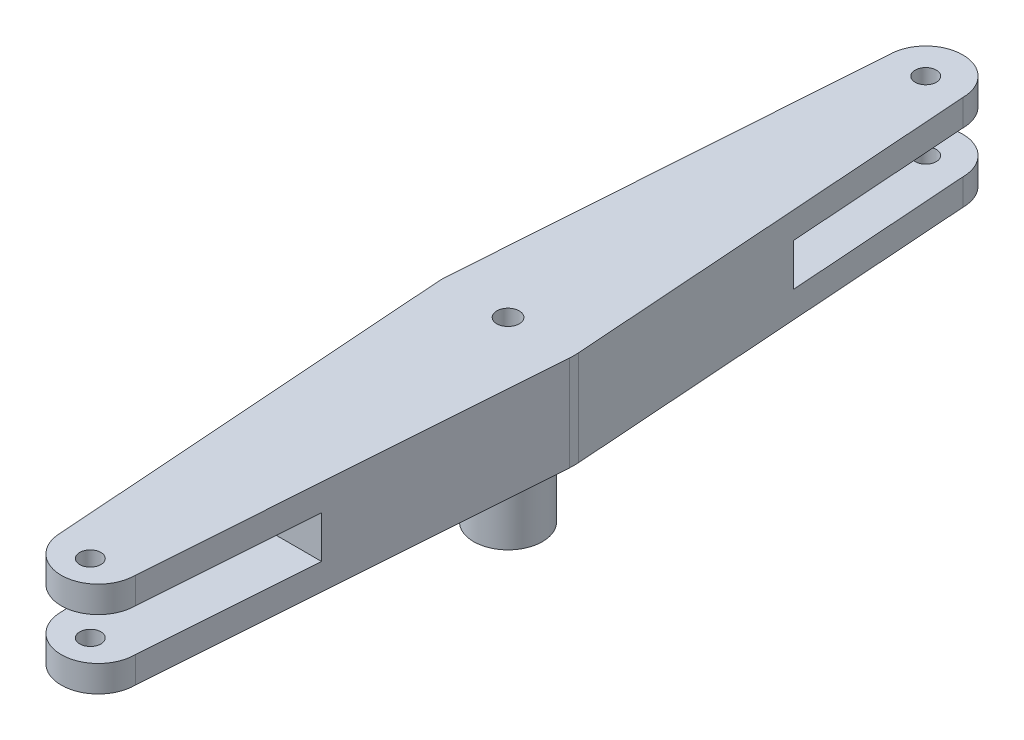
ISO-10303-21;
HEADER;
FILE_DESCRIPTION(('STEP AP214'),'2;1');
FILE_NAME('part.step','',(''),(''),'','','');
FILE_SCHEMA(('AUTOMOTIVE_DESIGN { 1 0 10303 214 1 1 1 1 }'));
ENDSEC;
DATA;
#1=APPLICATION_CONTEXT('core data for automotive mechanical design processes');
#2=APPLICATION_PROTOCOL_DEFINITION('international standard','automotive_design',2000,#1);
#3=PRODUCT_CONTEXT('',#1,'mechanical');
#4=PRODUCT('Part','Part','',(#3));
#5=PRODUCT_RELATED_PRODUCT_CATEGORY('part','',(#4));
#6=PRODUCT_DEFINITION_FORMATION('','',#4);
#7=PRODUCT_DEFINITION_CONTEXT('part definition',#1,'design');
#8=PRODUCT_DEFINITION('design','',#6,#7);
#9=PRODUCT_DEFINITION_SHAPE('','',#8);
#10=(LENGTH_UNIT() NAMED_UNIT(*) SI_UNIT(.MILLI.,.METRE.));
#11=(NAMED_UNIT(*) PLANE_ANGLE_UNIT() SI_UNIT($,.RADIAN.));
#12=(NAMED_UNIT(*) SI_UNIT($,.STERADIAN.) SOLID_ANGLE_UNIT());
#13=UNCERTAINTY_MEASURE_WITH_UNIT(LENGTH_MEASURE(1.E-05),#10,'distance_accuracy_value','');
#14=(GEOMETRIC_REPRESENTATION_CONTEXT(3) GLOBAL_UNCERTAINTY_ASSIGNED_CONTEXT((#13)) GLOBAL_UNIT_ASSIGNED_CONTEXT((#10,
#11,#12)) REPRESENTATION_CONTEXT('',''));
#15=CARTESIAN_POINT('',(0.,0.,0.));
#16=DIRECTION('',(0.,0.,1.));
#17=DIRECTION('',(1.,0.,0.));
#18=AXIS2_PLACEMENT_3D('',#15,#16,#17);
#19=CARTESIAN_POINT('',(0.,5.,-79.));
#20=DIRECTION('',(0.,1.,0.));
#21=DIRECTION('',(0.,0.,1.));
#22=AXIS2_PLACEMENT_3D('',#19,#20,#21);
#23=PLANE('',#22);
#24=DIRECTION('',(1.,0.,0.));
#25=VECTOR('',#24,1.);
#26=CARTESIAN_POINT('',(-9.34696599194239,5.,44.6192395746421));
#27=LINE('',#26,#25);
#28=CARTESIAN_POINT('',(-9.34696599194239,5.,44.6192395746421));
#29=VERTEX_POINT('',#28);
#30=CARTESIAN_POINT('',(9.34696599194239,5.,44.6192395746421));
#31=VERTEX_POINT('',#30);
#32=EDGE_CURVE('E223',#29,#31,#27,.T.);
#33=ORIENTED_EDGE('',*,*,#32,.F.);
#34=DIRECTION('',(0.0711969556498861,0.,0.997462276733405));
#35=VECTOR('',#34,1.);
#36=CARTESIAN_POINT('',(-12.4682784591676,5.,0.889961945623576));
#37=LINE('',#36,#35);
#38=CARTESIAN_POINT('',(-6.99999999999999,5.,77.5));
#39=VERTEX_POINT('',#38);
#40=EDGE_CURVE('E262',#29,#39,#37,.T.);
#41=ORIENTED_EDGE('',*,*,#40,.T.);
#42=CARTESIAN_POINT('',(0.,5.,77.5));
#43=DIRECTION('',(0.,1.,0.));
#44=DIRECTION('',(0.,0.,1.));
#45=AXIS2_PLACEMENT_3D('',#42,#43,#44);
#46=CIRCLE('',#45,6.99999999999999);
#47=CARTESIAN_POINT('',(7.,5.,77.5));
#48=VERTEX_POINT('',#47);
#49=EDGE_CURVE('E264',#39,#48,#46,.T.);
#50=ORIENTED_EDGE('',*,*,#49,.T.);
#51=DIRECTION('',(0.0711969556498861,0.,-0.997462276733405));
#52=VECTOR('',#51,1.);
#53=CARTESIAN_POINT('',(12.4682784591676,5.,0.889961945623576));
#54=LINE('',#53,#52);
#55=EDGE_CURVE('E64',#48,#31,#54,.T.);
#56=ORIENTED_EDGE('',*,*,#55,.T.);
#57=EDGE_LOOP('',(#33,#41,#50,#56));
#58=FACE_BOUND('',#57,.T.);
#59=CARTESIAN_POINT('',(0.,5.,79.));
#60=DIRECTION('',(0.,1.,0.));
#61=DIRECTION('',(0.,0.,-1.));
#62=AXIS2_PLACEMENT_3D('',#59,#60,#61);
#63=CIRCLE('',#62,2.);
#64=CARTESIAN_POINT('',(0.,5.,77.));
#65=VERTEX_POINT('',#64);
#66=EDGE_CURVE('E242',#65,#65,#63,.T.);
#67=ORIENTED_EDGE('',*,*,#66,.F.);
#68=EDGE_LOOP('',(#67));
#69=FACE_BOUND('',#68,.T.);
#70=ADVANCED_FACE('F39',(#58,#69),#23,.T.);
#71=DIRECTION('',(-1.,0.,0.));
#72=VECTOR('',#71,1.);
#73=CARTESIAN_POINT('',(-9.40691179962771,5.,-44.6192395746421));
#74=LINE('',#73,#72);
#75=CARTESIAN_POINT('',(9.40691179962771,5.,-44.6192395746421));
#76=VERTEX_POINT('',#75);
#77=CARTESIAN_POINT('',(-9.40691179962771,5.,-44.6192395746421));
#78=VERTEX_POINT('',#77);
#79=EDGE_CURVE('E56',#76,#78,#74,.T.);
#80=ORIENTED_EDGE('',*,*,#79,.F.);
#81=DIRECTION('',(-0.0698365935248016,0.,-0.99755844450581));
#82=VECTOR('',#81,1.);
#83=CARTESIAN_POINT('',(12.4694805563226,5.,-0.87295741906002));
#84=LINE('',#83,#82);
#85=CARTESIAN_POINT('',(7.,5.,-79.));
#86=VERTEX_POINT('',#85);
#87=EDGE_CURVE('E267',#76,#86,#84,.T.);
#88=ORIENTED_EDGE('',*,*,#87,.T.);
#89=CARTESIAN_POINT('',(0.,5.,-79.));
#90=DIRECTION('',(0.,1.,0.));
#91=DIRECTION('',(0.,0.,1.));
#92=AXIS2_PLACEMENT_3D('',#89,#90,#91);
#93=CIRCLE('',#92,7.);
#94=CARTESIAN_POINT('',(-7.,5.,-79.));
#95=VERTEX_POINT('',#94);
#96=EDGE_CURVE('E256',#86,#95,#93,.T.);
#97=ORIENTED_EDGE('',*,*,#96,.T.);
#98=DIRECTION('',(-0.0698365935248016,0.,0.99755844450581));
#99=VECTOR('',#98,1.);
#100=CARTESIAN_POINT('',(-7.,5.,-79.));
#101=LINE('',#100,#99);
#102=EDGE_CURVE('E259',#95,#78,#101,.T.);
#103=ORIENTED_EDGE('',*,*,#102,.T.);
#104=EDGE_LOOP('',(#80,#88,#97,#103));
#105=FACE_BOUND('',#104,.T.);
#106=CARTESIAN_POINT('',(0.,5.,-79.));
#107=DIRECTION('',(0.,1.,0.));
#108=DIRECTION('',(0.,0.,1.));
#109=AXIS2_PLACEMENT_3D('',#106,#107,#108);
#110=CIRCLE('',#109,2.);
#111=CARTESIAN_POINT('',(0.,5.,-77.));
#112=VERTEX_POINT('',#111);
#113=EDGE_CURVE('E243',#112,#112,#110,.T.);
#114=ORIENTED_EDGE('',*,*,#113,.F.);
#115=EDGE_LOOP('',(#114));
#116=FACE_BOUND('',#115,.T.);
#117=ADVANCED_FACE('F361',(#105,#116),#23,.T.);
#118=CARTESIAN_POINT('',(0.,0.,-79.));
#119=DIRECTION('',(0.,1.,0.));
#120=DIRECTION('',(0.,0.,1.));
#121=AXIS2_PLACEMENT_3D('',#118,#119,#120);
#122=PLANE('',#121);
#123=CARTESIAN_POINT('',(0.,0.,0.));
#124=DIRECTION('',(0.,1.,0.));
#125=DIRECTION('',(0.,0.,1.));
#126=AXIS2_PLACEMENT_3D('',#123,#124,#125);
#127=CIRCLE('',#126,6.5);
#128=CARTESIAN_POINT('',(0.,0.,6.5));
#129=VERTEX_POINT('',#128);
#130=EDGE_CURVE('E11',#129,#129,#127,.F.);
#131=ORIENTED_EDGE('',*,*,#130,.F.);
#132=EDGE_LOOP('',(#131));
#133=FACE_BOUND('',#132,.T.);
#134=CARTESIAN_POINT('',(0.,0.,-79.));
#135=DIRECTION('',(0.,1.,0.));
#136=DIRECTION('',(0.,0.,1.));
#137=AXIS2_PLACEMENT_3D('',#134,#135,#136);
#138=CIRCLE('',#137,2.);
#139=CARTESIAN_POINT('',(0.,0.,-77.));
#140=VERTEX_POINT('',#139);
#141=EDGE_CURVE('E255',#140,#140,#138,.T.);
#142=ORIENTED_EDGE('',*,*,#141,.T.);
#143=EDGE_LOOP('',(#142));
#144=FACE_BOUND('',#143,.T.);
#145=CARTESIAN_POINT('',(0.,0.,79.));
#146=DIRECTION('',(0.,1.,0.));
#147=DIRECTION('',(0.,0.,1.));
#148=AXIS2_PLACEMENT_3D('',#145,#146,#147);
#149=CIRCLE('',#148,2.);
#150=CARTESIAN_POINT('',(0.,0.,81.));
#151=VERTEX_POINT('',#150);
#152=EDGE_CURVE('E246',#151,#151,#149,.T.);
#153=ORIENTED_EDGE('',*,*,#152,.T.);
#154=EDGE_LOOP('',(#153));
#155=FACE_BOUND('',#154,.T.);
#156=CARTESIAN_POINT('',(0.,0.,-79.));
#157=DIRECTION('',(0.,1.,0.));
#158=DIRECTION('',(0.,0.,1.));
#159=AXIS2_PLACEMENT_3D('',#156,#157,#158);
#160=CIRCLE('',#159,7.);
#161=CARTESIAN_POINT('',(7.,0.,-79.));
#162=VERTEX_POINT('',#161);
#163=CARTESIAN_POINT('',(-7.,0.,-79.));
#164=VERTEX_POINT('',#163);
#165=EDGE_CURVE('E254',#162,#164,#160,.T.);
#166=ORIENTED_EDGE('',*,*,#165,.F.);
#167=DIRECTION('',(-0.0698365935248016,0.,-0.99755844450581));
#168=VECTOR('',#167,1.);
#169=CARTESIAN_POINT('',(12.4694805563226,0.,-0.87295741906002));
#170=LINE('',#169,#168);
#171=CARTESIAN_POINT('',(12.4694805563226,0.,-0.87295741906002));
#172=VERTEX_POINT('',#171);
#173=EDGE_CURVE('E260',#172,#162,#170,.T.);
#174=ORIENTED_EDGE('',*,*,#173,.F.);
#175=CARTESIAN_POINT('',(0.,0.,0.));
#176=DIRECTION('',(0.,1.,0.));
#177=DIRECTION('',(0.,0.,1.));
#178=AXIS2_PLACEMENT_3D('',#175,#176,#177);
#179=CIRCLE('',#178,12.5);
#180=CARTESIAN_POINT('',(12.4682784591676,0.,0.889961945623576));
#181=VERTEX_POINT('',#180);
#182=EDGE_CURVE('E282',#181,#172,#179,.T.);
#183=ORIENTED_EDGE('',*,*,#182,.F.);
#184=DIRECTION('',(0.0711969556498861,0.,-0.997462276733405));
#185=VECTOR('',#184,1.);
#186=CARTESIAN_POINT('',(12.4682784591676,0.,0.889961945623576));
#187=LINE('',#186,#185);
#188=CARTESIAN_POINT('',(7.,0.,77.5));
#189=VERTEX_POINT('',#188);
#190=EDGE_CURVE('E280',#189,#181,#187,.T.);
#191=ORIENTED_EDGE('',*,*,#190,.F.);
#192=CARTESIAN_POINT('',(0.,0.,77.5));
#193=DIRECTION('',(0.,1.,0.));
#194=DIRECTION('',(0.,0.,1.));
#195=AXIS2_PLACEMENT_3D('',#192,#193,#194);
#196=CIRCLE('',#195,6.99999999999999);
#197=CARTESIAN_POINT('',(-6.99999999999999,0.,77.5));
#198=VERTEX_POINT('',#197);
#199=EDGE_CURVE('E278',#198,#189,#196,.T.);
#200=ORIENTED_EDGE('',*,*,#199,.F.);
#201=DIRECTION('',(0.0711969556498861,0.,0.997462276733405));
#202=VECTOR('',#201,1.);
#203=CARTESIAN_POINT('',(-12.4682784591676,0.,0.889961945623576));
#204=LINE('',#203,#202);
#205=CARTESIAN_POINT('',(-12.4682784591676,0.,0.889961945623566));
#206=VERTEX_POINT('',#205);
#207=EDGE_CURVE('E276',#206,#198,#204,.T.);
#208=ORIENTED_EDGE('',*,*,#207,.F.);
#209=CARTESIAN_POINT('',(0.,0.,0.));
#210=DIRECTION('',(0.,1.,0.));
#211=DIRECTION('',(0.,0.,1.));
#212=AXIS2_PLACEMENT_3D('',#209,#210,#211);
#213=CIRCLE('',#212,12.5);
#214=CARTESIAN_POINT('',(-12.4694805563226,0.,-0.87295741906002));
#215=VERTEX_POINT('',#214);
#216=EDGE_CURVE('E274',#215,#206,#213,.T.);
#217=ORIENTED_EDGE('',*,*,#216,.F.);
#218=DIRECTION('',(-0.0698365935248016,0.,0.99755844450581));
#219=VECTOR('',#218,1.);
#220=CARTESIAN_POINT('',(-7.,0.,-79.));
#221=LINE('',#220,#219);
#222=EDGE_CURVE('E272',#164,#215,#221,.T.);
#223=ORIENTED_EDGE('',*,*,#222,.F.);
#224=EDGE_LOOP('',(#166,#174,#183,#191,#200,#208,#217,#223));
#225=FACE_BOUND('',#224,.T.);
#226=ADVANCED_FACE('F366',(#133,#144,#155,#225),#122,.F.);
#227=CARTESIAN_POINT('',(0.,5.,-79.));
#228=DIRECTION('',(0.,-1.,0.));
#229=DIRECTION('',(0.,0.,-1.));
#230=AXIS2_PLACEMENT_3D('',#227,#228,#229);
#231=CYLINDRICAL_SURFACE('',#230,7.);
#232=ORIENTED_EDGE('',*,*,#165,.T.);
#233=DIRECTION('',(0.,-1.,0.));
#234=VECTOR('',#233,1.);
#235=CARTESIAN_POINT('',(-7.,5.,-79.));
#236=LINE('',#235,#234);
#237=EDGE_CURVE('E48',#95,#164,#236,.T.);
#238=ORIENTED_EDGE('',*,*,#237,.F.);
#239=ORIENTED_EDGE('',*,*,#96,.F.);
#240=DIRECTION('',(0.,-1.,0.));
#241=VECTOR('',#240,1.);
#242=CARTESIAN_POINT('',(7.,5.,-79.));
#243=LINE('',#242,#241);
#244=EDGE_CURVE('E269',#86,#162,#243,.T.);
#245=ORIENTED_EDGE('',*,*,#244,.T.);
#246=EDGE_LOOP('',(#232,#238,#239,#245));
#247=FACE_BOUND('',#246,.T.);
#248=ADVANCED_FACE('F41',(#247),#231,.T.);
#249=CARTESIAN_POINT('',(-7.,5.,-79.));
#250=DIRECTION('',(0.99755844450581,0.,0.0698365935248016));
#251=DIRECTION('',(0.0698365935248016,0.,-0.99755844450581));
#252=AXIS2_PLACEMENT_3D('',#249,#250,#251);
#253=PLANE('',#252);
#254=ORIENTED_EDGE('',*,*,#222,.T.);
#255=DIRECTION('',(0.,-1.,0.));
#256=VECTOR('',#255,1.);
#257=CARTESIAN_POINT('',(-12.4694805563226,5.,-0.87295741906002));
#258=LINE('',#257,#256);
#259=CARTESIAN_POINT('',(-12.4694805563226,18.,-0.87295741906002));
#260=VERTEX_POINT('',#259);
#261=EDGE_CURVE('E302',#260,#215,#258,.T.);
#262=ORIENTED_EDGE('',*,*,#261,.F.);
#263=DIRECTION('',(-0.0698365935248016,0.,0.99755844450581));
#264=VECTOR('',#263,1.);
#265=CARTESIAN_POINT('',(-7.,18.,-79.));
#266=LINE('',#265,#264);
#267=CARTESIAN_POINT('',(-7.,18.,-79.));
#268=VERTEX_POINT('',#267);
#269=EDGE_CURVE('E180',#268,#260,#266,.T.);
#270=ORIENTED_EDGE('',*,*,#269,.F.);
#271=DIRECTION('',(0.,1.,0.));
#272=VECTOR('',#271,1.);
#273=CARTESIAN_POINT('',(-7.,13.,-79.));
#274=LINE('',#273,#272);
#275=CARTESIAN_POINT('',(-7.,13.,-79.));
#276=VERTEX_POINT('',#275);
#277=EDGE_CURVE('E197',#276,#268,#274,.T.);
#278=ORIENTED_EDGE('',*,*,#277,.F.);
#279=DIRECTION('',(-0.0698365935248016,0.,0.99755844450581));
#280=VECTOR('',#279,1.);
#281=CARTESIAN_POINT('',(-7.,13.,-79.));
#282=LINE('',#281,#280);
#283=CARTESIAN_POINT('',(-9.40691179962771,13.,-44.6192395746421));
#284=VERTEX_POINT('',#283);
#285=EDGE_CURVE('E179',#276,#284,#282,.T.);
#286=ORIENTED_EDGE('',*,*,#285,.T.);
#287=DIRECTION('',(0.,-1.,0.));
#288=VECTOR('',#287,1.);
#289=CARTESIAN_POINT('',(-9.40691179962771,13.,-44.6192395746421));
#290=LINE('',#289,#288);
#291=EDGE_CURVE('E234',#284,#78,#290,.T.);
#292=ORIENTED_EDGE('',*,*,#291,.T.);
#293=ORIENTED_EDGE('',*,*,#102,.F.);
#294=ORIENTED_EDGE('',*,*,#237,.T.);
#295=EDGE_LOOP('',(#254,#262,#270,#278,#286,#292,#293,#294));
#296=FACE_BOUND('',#295,.T.);
#297=ADVANCED_FACE('F396',(#296),#253,.F.);
#298=CARTESIAN_POINT('',(0.,5.,0.));
#299=DIRECTION('',(0.,-1.,0.));
#300=DIRECTION('',(0.,0.,-1.));
#301=AXIS2_PLACEMENT_3D('',#298,#299,#300);
#302=CYLINDRICAL_SURFACE('',#301,12.5);
#303=ORIENTED_EDGE('',*,*,#216,.T.);
#304=DIRECTION('',(0.,-1.,0.));
#305=VECTOR('',#304,1.);
#306=CARTESIAN_POINT('',(-12.4682784591676,5.,0.889961945623566));
#307=LINE('',#306,#305);
#308=CARTESIAN_POINT('',(-12.4682784591676,18.,0.889961945623566));
#309=VERTEX_POINT('',#308);
#310=EDGE_CURVE('E299',#309,#206,#307,.T.);
#311=ORIENTED_EDGE('',*,*,#310,.F.);
#312=CARTESIAN_POINT('',(0.,18.,0.));
#313=DIRECTION('',(0.,1.,0.));
#314=DIRECTION('',(0.,0.,1.));
#315=AXIS2_PLACEMENT_3D('',#312,#313,#314);
#316=CIRCLE('',#315,12.5);
#317=EDGE_CURVE('E183',#260,#309,#316,.T.);
#318=ORIENTED_EDGE('',*,*,#317,.F.);
#319=ORIENTED_EDGE('',*,*,#261,.T.);
#320=EDGE_LOOP('',(#303,#311,#318,#319));
#321=FACE_BOUND('',#320,.T.);
#322=ADVANCED_FACE('F393',(#321),#302,.T.);
#323=CARTESIAN_POINT('',(-12.4682784591676,5.,0.889961945623576));
#324=DIRECTION('',(0.997462276733405,0.,-0.0711969556498861));
#325=DIRECTION('',(-0.0711969556498861,0.,-0.997462276733405));
#326=AXIS2_PLACEMENT_3D('',#323,#324,#325);
#327=PLANE('',#326);
#328=ORIENTED_EDGE('',*,*,#207,.T.);
#329=DIRECTION('',(0.,-1.,0.));
#330=VECTOR('',#329,1.);
#331=CARTESIAN_POINT('',(-6.99999999999999,5.,77.5));
#332=LINE('',#331,#330);
#333=EDGE_CURVE('E296',#39,#198,#332,.T.);
#334=ORIENTED_EDGE('',*,*,#333,.F.);
#335=ORIENTED_EDGE('',*,*,#40,.F.);
#336=DIRECTION('',(0.,-1.,0.));
#337=VECTOR('',#336,1.);
#338=CARTESIAN_POINT('',(-9.34696599194239,13.,44.6192395746421));
#339=LINE('',#338,#337);
#340=CARTESIAN_POINT('',(-9.34696599194239,13.,44.6192395746421));
#341=VERTEX_POINT('',#340);
#342=EDGE_CURVE('E231',#341,#29,#339,.T.);
#343=ORIENTED_EDGE('',*,*,#342,.F.);
#344=DIRECTION('',(0.0711969556498861,0.,0.997462276733405));
#345=VECTOR('',#344,1.);
#346=CARTESIAN_POINT('',(-12.4682784591676,13.,0.889961945623576));
#347=LINE('',#346,#345);
#348=CARTESIAN_POINT('',(-6.99999999999999,13.,77.5));
#349=VERTEX_POINT('',#348);
#350=EDGE_CURVE('E194',#341,#349,#347,.T.);
#351=ORIENTED_EDGE('',*,*,#350,.T.);
#352=DIRECTION('',(0.,1.,0.));
#353=VECTOR('',#352,1.);
#354=CARTESIAN_POINT('',(-6.99999999999999,13.,77.5));
#355=LINE('',#354,#353);
#356=CARTESIAN_POINT('',(-6.99999999999999,18.,77.5));
#357=VERTEX_POINT('',#356);
#358=EDGE_CURVE('E217',#349,#357,#355,.T.);
#359=ORIENTED_EDGE('',*,*,#358,.T.);
#360=DIRECTION('',(0.0711969556498861,0.,0.997462276733405));
#361=VECTOR('',#360,1.);
#362=CARTESIAN_POINT('',(-12.4682784591676,18.,0.889961945623576));
#363=LINE('',#362,#361);
#364=EDGE_CURVE('E211',#309,#357,#363,.T.);
#365=ORIENTED_EDGE('',*,*,#364,.F.);
#366=ORIENTED_EDGE('',*,*,#310,.T.);
#367=EDGE_LOOP('',(#328,#334,#335,#343,#351,#359,#365,#366));
#368=FACE_BOUND('',#367,.T.);
#369=ADVANCED_FACE('F389',(#368),#327,.F.);
#370=CARTESIAN_POINT('',(0.,5.,77.5));
#371=DIRECTION('',(0.,-1.,0.));
#372=DIRECTION('',(0.,0.,-1.));
#373=AXIS2_PLACEMENT_3D('',#370,#371,#372);
#374=CYLINDRICAL_SURFACE('',#373,6.99999999999999);
#375=ORIENTED_EDGE('',*,*,#199,.T.);
#376=DIRECTION('',(0.,-1.,0.));
#377=VECTOR('',#376,1.);
#378=CARTESIAN_POINT('',(7.,5.,77.5));
#379=LINE('',#378,#377);
#380=EDGE_CURVE('E293',#48,#189,#379,.T.);
#381=ORIENTED_EDGE('',*,*,#380,.F.);
#382=ORIENTED_EDGE('',*,*,#49,.F.);
#383=ORIENTED_EDGE('',*,*,#333,.T.);
#384=EDGE_LOOP('',(#375,#381,#382,#383));
#385=FACE_BOUND('',#384,.T.);
#386=ADVANCED_FACE('F385',(#385),#374,.T.);
#387=CARTESIAN_POINT('',(12.4682784591676,5.,0.889961945623576));
#388=DIRECTION('',(-0.997462276733405,0.,-0.0711969556498861));
#389=DIRECTION('',(-0.0711969556498861,0.,0.997462276733405));
#390=AXIS2_PLACEMENT_3D('',#387,#388,#389);
#391=PLANE('',#390);
#392=ORIENTED_EDGE('',*,*,#190,.T.);
#393=DIRECTION('',(0.,-1.,0.));
#394=VECTOR('',#393,1.);
#395=CARTESIAN_POINT('',(12.4682784591676,5.,0.889961945623576));
#396=LINE('',#395,#394);
#397=CARTESIAN_POINT('',(12.4682784591676,18.,0.889961945623576));
#398=VERTEX_POINT('',#397);
#399=EDGE_CURVE('E290',#398,#181,#396,.T.);
#400=ORIENTED_EDGE('',*,*,#399,.F.);
#401=DIRECTION('',(0.0711969556498861,0.,-0.997462276733405));
#402=VECTOR('',#401,1.);
#403=CARTESIAN_POINT('',(12.4682784591676,18.,0.889961945623576));
#404=LINE('',#403,#402);
#405=CARTESIAN_POINT('',(7.,18.,77.5));
#406=VERTEX_POINT('',#405);
#407=EDGE_CURVE('E205',#406,#398,#404,.T.);
#408=ORIENTED_EDGE('',*,*,#407,.F.);
#409=DIRECTION('',(0.,1.,0.));
#410=VECTOR('',#409,1.);
#411=CARTESIAN_POINT('',(7.,13.,77.5));
#412=LINE('',#411,#410);
#413=CARTESIAN_POINT('',(7.,13.,77.5));
#414=VERTEX_POINT('',#413);
#415=EDGE_CURVE('E175',#414,#406,#412,.T.);
#416=ORIENTED_EDGE('',*,*,#415,.F.);
#417=DIRECTION('',(0.0711969556498861,0.,-0.997462276733405));
#418=VECTOR('',#417,1.);
#419=CARTESIAN_POINT('',(12.4682784591676,13.,0.889961945623576));
#420=LINE('',#419,#418);
#421=CARTESIAN_POINT('',(9.34696599194239,13.,44.6192395746421));
#422=VERTEX_POINT('',#421);
#423=EDGE_CURVE('E165',#414,#422,#420,.T.);
#424=ORIENTED_EDGE('',*,*,#423,.T.);
#425=DIRECTION('',(0.,-1.,0.));
#426=VECTOR('',#425,1.);
#427=CARTESIAN_POINT('',(9.34696599194239,13.,44.6192395746421));
#428=LINE('',#427,#426);
#429=EDGE_CURVE('E226',#422,#31,#428,.T.);
#430=ORIENTED_EDGE('',*,*,#429,.T.);
#431=ORIENTED_EDGE('',*,*,#55,.F.);
#432=ORIENTED_EDGE('',*,*,#380,.T.);
#433=EDGE_LOOP('',(#392,#400,#408,#416,#424,#430,#431,#432));
#434=FACE_BOUND('',#433,.T.);
#435=ADVANCED_FACE('F381',(#434),#391,.F.);
#436=CARTESIAN_POINT('',(0.,5.,0.));
#437=DIRECTION('',(0.,-1.,0.));
#438=DIRECTION('',(0.,0.,-1.));
#439=AXIS2_PLACEMENT_3D('',#436,#437,#438);
#440=CYLINDRICAL_SURFACE('',#439,12.5);
#441=ORIENTED_EDGE('',*,*,#182,.T.);
#442=DIRECTION('',(0.,-1.,0.));
#443=VECTOR('',#442,1.);
#444=CARTESIAN_POINT('',(12.4694805563226,5.,-0.87295741906002));
#445=LINE('',#444,#443);
#446=CARTESIAN_POINT('',(12.4694805563226,18.,-0.87295741906002));
#447=VERTEX_POINT('',#446);
#448=EDGE_CURVE('E287',#447,#172,#445,.T.);
#449=ORIENTED_EDGE('',*,*,#448,.F.);
#450=CARTESIAN_POINT('',(0.,18.,0.));
#451=DIRECTION('',(0.,1.,0.));
#452=DIRECTION('',(0.,0.,1.));
#453=AXIS2_PLACEMENT_3D('',#450,#451,#452);
#454=CIRCLE('',#453,12.5);
#455=EDGE_CURVE('E202',#398,#447,#454,.T.);
#456=ORIENTED_EDGE('',*,*,#455,.F.);
#457=ORIENTED_EDGE('',*,*,#399,.T.);
#458=EDGE_LOOP('',(#441,#449,#456,#457));
#459=FACE_BOUND('',#458,.T.);
#460=ADVANCED_FACE('F378',(#459),#440,.T.);
#461=CARTESIAN_POINT('',(12.4694805563226,5.,-0.87295741906002));
#462=DIRECTION('',(-0.99755844450581,0.,0.0698365935248016));
#463=DIRECTION('',(0.0698365935248016,0.,0.99755844450581));
#464=AXIS2_PLACEMENT_3D('',#461,#462,#463);
#465=PLANE('',#464);
#466=ORIENTED_EDGE('',*,*,#173,.T.);
#467=ORIENTED_EDGE('',*,*,#244,.F.);
#468=ORIENTED_EDGE('',*,*,#87,.F.);
#469=DIRECTION('',(0.,-1.,0.));
#470=VECTOR('',#469,1.);
#471=CARTESIAN_POINT('',(9.40691179962771,13.,-44.6192395746421));
#472=LINE('',#471,#470);
#473=CARTESIAN_POINT('',(9.40691179962771,13.,-44.6192395746421));
#474=VERTEX_POINT('',#473);
#475=EDGE_CURVE('E161',#474,#76,#472,.T.);
#476=ORIENTED_EDGE('',*,*,#475,.F.);
#477=DIRECTION('',(-0.0698365935248016,0.,-0.99755844450581));
#478=VECTOR('',#477,1.);
#479=CARTESIAN_POINT('',(12.4694805563226,13.,-0.87295741906002));
#480=LINE('',#479,#478);
#481=CARTESIAN_POINT('',(7.,13.,-79.));
#482=VERTEX_POINT('',#481);
#483=EDGE_CURVE('E154',#474,#482,#480,.T.);
#484=ORIENTED_EDGE('',*,*,#483,.T.);
#485=DIRECTION('',(0.,1.,0.));
#486=VECTOR('',#485,1.);
#487=CARTESIAN_POINT('',(7.,13.,-79.));
#488=LINE('',#487,#486);
#489=CARTESIAN_POINT('',(7.,18.,-79.));
#490=VERTEX_POINT('',#489);
#491=EDGE_CURVE('E158',#482,#490,#488,.T.);
#492=ORIENTED_EDGE('',*,*,#491,.T.);
#493=DIRECTION('',(-0.0698365935248016,0.,-0.99755844450581));
#494=VECTOR('',#493,1.);
#495=CARTESIAN_POINT('',(12.4694805563226,18.,-0.87295741906002));
#496=LINE('',#495,#494);
#497=EDGE_CURVE('E199',#447,#490,#496,.T.);
#498=ORIENTED_EDGE('',*,*,#497,.F.);
#499=ORIENTED_EDGE('',*,*,#448,.T.);
#500=EDGE_LOOP('',(#466,#467,#468,#476,#484,#492,#498,#499));
#501=FACE_BOUND('',#500,.T.);
#502=ADVANCED_FACE('F156',(#501),#465,.F.);
#503=CARTESIAN_POINT('',(0.,-5.,79.));
#504=DIRECTION('',(0.,1.,0.));
#505=DIRECTION('',(0.,0.,1.));
#506=AXIS2_PLACEMENT_3D('',#503,#504,#505);
#507=CYLINDRICAL_SURFACE('',#506,2.);
#508=ORIENTED_EDGE('',*,*,#66,.T.);
#509=EDGE_LOOP('',(#508));
#510=FACE_BOUND('',#509,.T.);
#511=ORIENTED_EDGE('',*,*,#152,.F.);
#512=EDGE_LOOP('',(#511));
#513=FACE_BOUND('',#512,.T.);
#514=ADVANCED_FACE('F377',(#510,#513),#507,.F.);
#515=CARTESIAN_POINT('',(0.,-5.,-79.));
#516=DIRECTION('',(0.,1.,0.));
#517=DIRECTION('',(0.,0.,1.));
#518=AXIS2_PLACEMENT_3D('',#515,#516,#517);
#519=CYLINDRICAL_SURFACE('',#518,2.);
#520=ORIENTED_EDGE('',*,*,#113,.T.);
#521=EDGE_LOOP('',(#520));
#522=FACE_BOUND('',#521,.T.);
#523=ORIENTED_EDGE('',*,*,#141,.F.);
#524=EDGE_LOOP('',(#523));
#525=FACE_BOUND('',#524,.T.);
#526=ADVANCED_FACE('F456',(#522,#525),#519,.F.);
#527=CARTESIAN_POINT('',(0.,-15.5,0.));
#528=DIRECTION('',(0.,1.,0.));
#529=DIRECTION('',(0.,0.,1.));
#530=AXIS2_PLACEMENT_3D('',#527,#528,#529);
#531=CYLINDRICAL_SURFACE('',#530,6.5);
#532=CARTESIAN_POINT('',(0.,-15.5,0.));
#533=DIRECTION('',(0.,-1.,0.));
#534=DIRECTION('',(0.,0.,-1.));
#535=AXIS2_PLACEMENT_3D('',#532,#533,#534);
#536=CIRCLE('',#535,6.5);
#537=CARTESIAN_POINT('',(0.,-15.5,-6.5));
#538=VERTEX_POINT('',#537);
#539=EDGE_CURVE('E239',#538,#538,#536,.T.);
#540=ORIENTED_EDGE('',*,*,#539,.F.);
#541=EDGE_LOOP('',(#540));
#542=FACE_BOUND('',#541,.T.);
#543=ORIENTED_EDGE('',*,*,#130,.T.);
#544=EDGE_LOOP('',(#543));
#545=FACE_BOUND('',#544,.T.);
#546=ADVANCED_FACE('F449',(#542,#545),#531,.T.);
#547=CARTESIAN_POINT('',(0.,-15.5,0.));
#548=DIRECTION('',(0.,-1.,0.));
#549=DIRECTION('',(0.,0.,-1.));
#550=AXIS2_PLACEMENT_3D('',#547,#548,#549);
#551=PLANE('',#550);
#552=CARTESIAN_POINT('',(0.,-15.5,0.));
#553=DIRECTION('',(0.,-1.,0.));
#554=DIRECTION('',(0.,0.,-1.));
#555=AXIS2_PLACEMENT_3D('',#552,#553,#554);
#556=CIRCLE('',#555,2.);
#557=CARTESIAN_POINT('',(0.,-15.5,-2.));
#558=VERTEX_POINT('',#557);
#559=EDGE_CURVE('E336',#558,#558,#556,.T.);
#560=ORIENTED_EDGE('',*,*,#559,.F.);
#561=EDGE_LOOP('',(#560));
#562=FACE_BOUND('',#561,.T.);
#563=ORIENTED_EDGE('',*,*,#539,.T.);
#564=EDGE_LOOP('',(#563));
#565=FACE_BOUND('',#564,.T.);
#566=ADVANCED_FACE('F443',(#562,#565),#551,.T.);
#567=CARTESIAN_POINT('',(-9.34696599194239,13.,44.6192395746421));
#568=DIRECTION('',(0.,0.,-1.));
#569=DIRECTION('',(-1.,0.,0.));
#570=AXIS2_PLACEMENT_3D('',#567,#568,#569);
#571=PLANE('',#570);
#572=ORIENTED_EDGE('',*,*,#32,.T.);
#573=ORIENTED_EDGE('',*,*,#429,.F.);
#574=DIRECTION('',(1.,0.,0.));
#575=VECTOR('',#574,1.);
#576=CARTESIAN_POINT('',(-9.34696599194239,13.,44.6192395746421));
#577=LINE('',#576,#575);
#578=EDGE_CURVE('E222',#341,#422,#577,.T.);
#579=ORIENTED_EDGE('',*,*,#578,.F.);
#580=ORIENTED_EDGE('',*,*,#342,.T.);
#581=EDGE_LOOP('',(#572,#573,#579,#580));
#582=FACE_BOUND('',#581,.T.);
#583=ADVANCED_FACE('F420',(#582),#571,.F.);
#584=CARTESIAN_POINT('',(-9.40691179962771,13.,-44.6192395746421));
#585=DIRECTION('',(0.,0.,1.));
#586=DIRECTION('',(1.,0.,0.));
#587=AXIS2_PLACEMENT_3D('',#584,#585,#586);
#588=PLANE('',#587);
#589=ORIENTED_EDGE('',*,*,#79,.T.);
#590=ORIENTED_EDGE('',*,*,#291,.F.);
#591=DIRECTION('',(-1.,0.,0.));
#592=VECTOR('',#591,1.);
#593=CARTESIAN_POINT('',(-9.40691179962771,13.,-44.6192395746421));
#594=LINE('',#593,#592);
#595=EDGE_CURVE('E220',#474,#284,#594,.T.);
#596=ORIENTED_EDGE('',*,*,#595,.F.);
#597=ORIENTED_EDGE('',*,*,#475,.T.);
#598=EDGE_LOOP('',(#589,#590,#596,#597));
#599=FACE_BOUND('',#598,.T.);
#600=ADVANCED_FACE('F434',(#599),#588,.F.);
#601=CARTESIAN_POINT('',(0.,13.,-79.));
#602=DIRECTION('',(0.,-1.,0.));
#603=DIRECTION('',(0.,0.,1.));
#604=AXIS2_PLACEMENT_3D('',#601,#602,#603);
#605=PLANE('',#604);
#606=CARTESIAN_POINT('',(0.,13.,-79.));
#607=DIRECTION('',(0.,1.,0.));
#608=DIRECTION('',(0.,0.,1.));
#609=AXIS2_PLACEMENT_3D('',#606,#607,#608);
#610=CIRCLE('',#609,2.);
#611=CARTESIAN_POINT('',(0.,13.,-77.));
#612=VERTEX_POINT('',#611);
#613=EDGE_CURVE('E314',#612,#612,#610,.T.);
#614=ORIENTED_EDGE('',*,*,#613,.T.);
#615=EDGE_LOOP('',(#614));
#616=FACE_BOUND('',#615,.T.);
#617=ORIENTED_EDGE('',*,*,#483,.F.);
#618=ORIENTED_EDGE('',*,*,#595,.T.);
#619=ORIENTED_EDGE('',*,*,#285,.F.);
#620=CARTESIAN_POINT('',(0.,13.,-79.));
#621=DIRECTION('',(0.,1.,0.));
#622=DIRECTION('',(0.,0.,1.));
#623=AXIS2_PLACEMENT_3D('',#620,#621,#622);
#624=CIRCLE('',#623,7.);
#625=EDGE_CURVE('E166',#482,#276,#624,.T.);
#626=ORIENTED_EDGE('',*,*,#625,.F.);
#627=EDGE_LOOP('',(#617,#618,#619,#626));
#628=FACE_BOUND('',#627,.T.);
#629=ADVANCED_FACE('F177',(#616,#628),#605,.T.);
#630=CARTESIAN_POINT('',(0.,13.,-79.));
#631=DIRECTION('',(0.,1.,0.));
#632=DIRECTION('',(0.,0.,1.));
#633=AXIS2_PLACEMENT_3D('',#630,#631,#632);
#634=CYLINDRICAL_SURFACE('',#633,7.);
#635=CARTESIAN_POINT('',(0.,18.,-79.));
#636=DIRECTION('',(0.,1.,0.));
#637=DIRECTION('',(0.,0.,1.));
#638=AXIS2_PLACEMENT_3D('',#635,#636,#637);
#639=CIRCLE('',#638,7.);
#640=EDGE_CURVE('E173',#490,#268,#639,.T.);
#641=ORIENTED_EDGE('',*,*,#640,.F.);
#642=ORIENTED_EDGE('',*,*,#491,.F.);
#643=ORIENTED_EDGE('',*,*,#625,.T.);
#644=ORIENTED_EDGE('',*,*,#277,.T.);
#645=EDGE_LOOP('',(#641,#642,#643,#644));
#646=FACE_BOUND('',#645,.T.);
#647=ADVANCED_FACE('F170',(#646),#634,.T.);
#648=CARTESIAN_POINT('',(0.,13.,77.5));
#649=DIRECTION('',(0.,1.,0.));
#650=DIRECTION('',(0.,0.,1.));
#651=AXIS2_PLACEMENT_3D('',#648,#649,#650);
#652=CYLINDRICAL_SURFACE('',#651,6.99999999999999);
#653=CARTESIAN_POINT('',(0.,18.,77.5));
#654=DIRECTION('',(0.,1.,0.));
#655=DIRECTION('',(0.,0.,1.));
#656=AXIS2_PLACEMENT_3D('',#653,#654,#655);
#657=CIRCLE('',#656,6.99999999999999);
#658=EDGE_CURVE('E208',#357,#406,#657,.T.);
#659=ORIENTED_EDGE('',*,*,#658,.F.);
#660=ORIENTED_EDGE('',*,*,#358,.F.);
#661=CARTESIAN_POINT('',(0.,13.,77.5));
#662=DIRECTION('',(0.,1.,0.));
#663=DIRECTION('',(0.,0.,1.));
#664=AXIS2_PLACEMENT_3D('',#661,#662,#663);
#665=CIRCLE('',#664,6.99999999999999);
#666=EDGE_CURVE('E191',#349,#414,#665,.T.);
#667=ORIENTED_EDGE('',*,*,#666,.T.);
#668=ORIENTED_EDGE('',*,*,#415,.T.);
#669=EDGE_LOOP('',(#659,#660,#667,#668));
#670=FACE_BOUND('',#669,.T.);
#671=ADVANCED_FACE('F429',(#670),#652,.T.);
#672=CARTESIAN_POINT('',(0.,13.,79.));
#673=DIRECTION('',(0.,1.,0.));
#674=DIRECTION('',(0.,0.,-1.));
#675=AXIS2_PLACEMENT_3D('',#672,#673,#674);
#676=CIRCLE('',#675,2.);
#677=CARTESIAN_POINT('',(0.,13.,77.));
#678=VERTEX_POINT('',#677);
#679=EDGE_CURVE('E325',#678,#678,#676,.T.);
#680=ORIENTED_EDGE('',*,*,#679,.T.);
#681=EDGE_LOOP('',(#680));
#682=FACE_BOUND('',#681,.T.);
#683=ORIENTED_EDGE('',*,*,#350,.F.);
#684=ORIENTED_EDGE('',*,*,#578,.T.);
#685=ORIENTED_EDGE('',*,*,#423,.F.);
#686=ORIENTED_EDGE('',*,*,#666,.F.);
#687=EDGE_LOOP('',(#683,#684,#685,#686));
#688=FACE_BOUND('',#687,.T.);
#689=ADVANCED_FACE('F425',(#682,#688),#605,.T.);
#690=CARTESIAN_POINT('',(0.,18.,-79.));
#691=DIRECTION('',(0.,-1.,0.));
#692=DIRECTION('',(0.,0.,1.));
#693=AXIS2_PLACEMENT_3D('',#690,#691,#692);
#694=PLANE('',#693);
#695=CARTESIAN_POINT('',(0.,18.,-79.));
#696=DIRECTION('',(0.,-1.,0.));
#697=DIRECTION('',(0.,0.,-1.));
#698=AXIS2_PLACEMENT_3D('',#695,#696,#697);
#699=CIRCLE('',#698,2.);
#700=CARTESIAN_POINT('',(0.,18.,-81.));
#701=VERTEX_POINT('',#700);
#702=EDGE_CURVE('E313',#701,#701,#699,.F.);
#703=ORIENTED_EDGE('',*,*,#702,.F.);
#704=EDGE_LOOP('',(#703));
#705=FACE_BOUND('',#704,.T.);
#706=CARTESIAN_POINT('',(0.,18.,79.));
#707=DIRECTION('',(0.,-1.,0.));
#708=DIRECTION('',(0.,0.,-1.));
#709=AXIS2_PLACEMENT_3D('',#706,#707,#708);
#710=CIRCLE('',#709,2.);
#711=CARTESIAN_POINT('',(0.,18.,77.));
#712=VERTEX_POINT('',#711);
#713=EDGE_CURVE('E311',#712,#712,#710,.F.);
#714=ORIENTED_EDGE('',*,*,#713,.F.);
#715=EDGE_LOOP('',(#714));
#716=FACE_BOUND('',#715,.T.);
#717=CARTESIAN_POINT('',(0.,18.,0.));
#718=DIRECTION('',(0.,1.,0.));
#719=DIRECTION('',(0.,0.,1.));
#720=AXIS2_PLACEMENT_3D('',#717,#718,#719);
#721=CIRCLE('',#720,2.125);
#722=CARTESIAN_POINT('',(0.,18.,2.125));
#723=VERTEX_POINT('',#722);
#724=EDGE_CURVE('E186',#723,#723,#721,.T.);
#725=ORIENTED_EDGE('',*,*,#724,.F.);
#726=EDGE_LOOP('',(#725));
#727=FACE_BOUND('',#726,.T.);
#728=ORIENTED_EDGE('',*,*,#640,.T.);
#729=ORIENTED_EDGE('',*,*,#269,.T.);
#730=ORIENTED_EDGE('',*,*,#317,.T.);
#731=ORIENTED_EDGE('',*,*,#364,.T.);
#732=ORIENTED_EDGE('',*,*,#658,.T.);
#733=ORIENTED_EDGE('',*,*,#407,.T.);
#734=ORIENTED_EDGE('',*,*,#455,.T.);
#735=ORIENTED_EDGE('',*,*,#497,.T.);
#736=EDGE_LOOP('',(#728,#729,#730,#731,#732,#733,#734,#735));
#737=FACE_BOUND('',#736,.T.);
#738=ADVANCED_FACE('F432',(#705,#716,#727,#737),#694,.F.);
#739=CARTESIAN_POINT('',(0.,13.,0.));
#740=DIRECTION('',(0.,1.,0.));
#741=DIRECTION('',(0.,0.,1.));
#742=AXIS2_PLACEMENT_3D('',#739,#740,#741);
#743=CYLINDRICAL_SURFACE('',#742,2.125);
#744=CARTESIAN_POINT('',(0.,13.,0.));
#745=DIRECTION('',(0.,1.,0.));
#746=DIRECTION('',(0.,0.,1.));
#747=AXIS2_PLACEMENT_3D('',#744,#745,#746);
#748=CIRCLE('',#747,2.125);
#749=CARTESIAN_POINT('',(0.,13.,2.125));
#750=VERTEX_POINT('',#749);
#751=EDGE_CURVE('E200',#750,#750,#748,.T.);
#752=ORIENTED_EDGE('',*,*,#751,.F.);
#753=EDGE_LOOP('',(#752));
#754=FACE_BOUND('',#753,.T.);
#755=ORIENTED_EDGE('',*,*,#724,.T.);
#756=EDGE_LOOP('',(#755));
#757=FACE_BOUND('',#756,.T.);
#758=ADVANCED_FACE('F538',(#754,#757),#743,.F.);
#759=CARTESIAN_POINT('',(0.,13.,0.));
#760=DIRECTION('',(0.,1.,0.));
#761=DIRECTION('',(0.,0.,1.));
#762=AXIS2_PLACEMENT_3D('',#759,#760,#761);
#763=PLANE('',#762);
#764=CARTESIAN_POINT('',(0.,13.,0.));
#765=DIRECTION('',(0.,1.,0.));
#766=DIRECTION('',(0.,0.,1.));
#767=AXIS2_PLACEMENT_3D('',#764,#765,#766);
#768=CIRCLE('',#767,2.);
#769=CARTESIAN_POINT('',(0.,13.,2.));
#770=VERTEX_POINT('',#769);
#771=EDGE_CURVE('E328',#770,#770,#768,.T.);
#772=ORIENTED_EDGE('',*,*,#771,.F.);
#773=EDGE_LOOP('',(#772));
#774=FACE_BOUND('',#773,.T.);
#775=ORIENTED_EDGE('',*,*,#751,.T.);
#776=EDGE_LOOP('',(#775));
#777=FACE_BOUND('',#776,.T.);
#778=ADVANCED_FACE('F548',(#774,#777),#763,.T.);
#779=CARTESIAN_POINT('',(0.,23.,79.));
#780=DIRECTION('',(0.,-1.,0.));
#781=DIRECTION('',(0.,0.,-1.));
#782=AXIS2_PLACEMENT_3D('',#779,#780,#781);
#783=CYLINDRICAL_SURFACE('',#782,2.);
#784=ORIENTED_EDGE('',*,*,#679,.F.);
#785=EDGE_LOOP('',(#784));
#786=FACE_BOUND('',#785,.T.);
#787=ORIENTED_EDGE('',*,*,#713,.T.);
#788=EDGE_LOOP('',(#787));
#789=FACE_BOUND('',#788,.T.);
#790=ADVANCED_FACE('F357',(#786,#789),#783,.F.);
#791=CARTESIAN_POINT('',(0.,23.,-79.));
#792=DIRECTION('',(0.,-1.,0.));
#793=DIRECTION('',(0.,0.,-1.));
#794=AXIS2_PLACEMENT_3D('',#791,#792,#793);
#795=CYLINDRICAL_SURFACE('',#794,2.);
#796=ORIENTED_EDGE('',*,*,#613,.F.);
#797=EDGE_LOOP('',(#796));
#798=FACE_BOUND('',#797,.T.);
#799=ORIENTED_EDGE('',*,*,#702,.T.);
#800=EDGE_LOOP('',(#799));
#801=FACE_BOUND('',#800,.T.);
#802=ADVANCED_FACE('F349',(#798,#801),#795,.F.);
#803=CARTESIAN_POINT('',(0.,18.,0.));
#804=DIRECTION('',(0.,-1.,0.));
#805=DIRECTION('',(0.,0.,-1.));
#806=AXIS2_PLACEMENT_3D('',#803,#804,#805);
#807=CYLINDRICAL_SURFACE('',#806,2.);
#808=ORIENTED_EDGE('',*,*,#771,.T.);
#809=EDGE_LOOP('',(#808));
#810=FACE_BOUND('',#809,.T.);
#811=CARTESIAN_POINT('',(0.,5.,0.));
#812=DIRECTION('',(0.,1.,0.));
#813=DIRECTION('',(0.,0.,1.));
#814=AXIS2_PLACEMENT_3D('',#811,#812,#813);
#815=CIRCLE('',#814,2.);
#816=CARTESIAN_POINT('',(0.,5.,2.));
#817=VERTEX_POINT('',#816);
#818=EDGE_CURVE('E43',#817,#817,#815,.T.);
#819=ORIENTED_EDGE('',*,*,#818,.F.);
#820=EDGE_LOOP('',(#819));
#821=FACE_BOUND('',#820,.T.);
#822=ADVANCED_FACE('F346',(#810,#821),#807,.F.);
#823=ORIENTED_EDGE('',*,*,#559,.T.);
#824=EDGE_LOOP('',(#823));
#825=FACE_BOUND('',#824,.T.);
#826=CARTESIAN_POINT('',(0.,0.,0.));
#827=DIRECTION('',(0.,-1.,0.));
#828=DIRECTION('',(0.,0.,-1.));
#829=AXIS2_PLACEMENT_3D('',#826,#827,#828);
#830=CIRCLE('',#829,2.);
#831=CARTESIAN_POINT('',(0.,0.,-2.));
#832=VERTEX_POINT('',#831);
#833=EDGE_CURVE('E333',#832,#832,#830,.T.);
#834=ORIENTED_EDGE('',*,*,#833,.F.);
#835=EDGE_LOOP('',(#834));
#836=FACE_BOUND('',#835,.T.);
#837=ADVANCED_FACE('F348',(#825,#836),#807,.F.);
#838=CARTESIAN_POINT('',(0.,0.,0.));
#839=DIRECTION('',(0.,-1.,0.));
#840=DIRECTION('',(0.,0.,-1.));
#841=AXIS2_PLACEMENT_3D('',#838,#839,#840);
#842=PLANE('',#841);
#843=ORIENTED_EDGE('',*,*,#833,.T.);
#844=EDGE_LOOP('',(#843));
#845=FACE_BOUND('',#844,.T.);
#846=CARTESIAN_POINT('',(0.,0.,0.));
#847=DIRECTION('',(0.,1.,0.));
#848=DIRECTION('',(0.,0.,1.));
#849=AXIS2_PLACEMENT_3D('',#846,#847,#848);
#850=CIRCLE('',#849,2.125);
#851=CARTESIAN_POINT('',(0.,0.,2.125));
#852=VERTEX_POINT('',#851);
#853=EDGE_CURVE('E251',#852,#852,#850,.T.);
#854=ORIENTED_EDGE('',*,*,#853,.T.);
#855=EDGE_LOOP('',(#854));
#856=FACE_BOUND('',#855,.T.);
#857=ADVANCED_FACE('F356',(#845,#856),#842,.F.);
#858=CARTESIAN_POINT('',(0.,5.,0.));
#859=DIRECTION('',(0.,-1.,0.));
#860=DIRECTION('',(0.,0.,-1.));
#861=AXIS2_PLACEMENT_3D('',#858,#859,#860);
#862=CYLINDRICAL_SURFACE('',#861,2.125);
#863=CARTESIAN_POINT('',(0.,5.,0.));
#864=DIRECTION('',(0.,1.,0.));
#865=DIRECTION('',(0.,0.,1.));
#866=AXIS2_PLACEMENT_3D('',#863,#864,#865);
#867=CIRCLE('',#866,2.125);
#868=CARTESIAN_POINT('',(0.,5.,2.125));
#869=VERTEX_POINT('',#868);
#870=EDGE_CURVE('E238',#869,#869,#867,.T.);
#871=ORIENTED_EDGE('',*,*,#870,.T.);
#872=EDGE_LOOP('',(#871));
#873=FACE_BOUND('',#872,.T.);
#874=ORIENTED_EDGE('',*,*,#853,.F.);
#875=EDGE_LOOP('',(#874));
#876=FACE_BOUND('',#875,.T.);
#877=ADVANCED_FACE('F370',(#873,#876),#862,.F.);
#878=CARTESIAN_POINT('',(0.,5.,0.));
#879=DIRECTION('',(0.,1.,0.));
#880=DIRECTION('',(0.,0.,1.));
#881=AXIS2_PLACEMENT_3D('',#878,#879,#880);
#882=PLANE('',#881);
#883=ORIENTED_EDGE('',*,*,#818,.T.);
#884=EDGE_LOOP('',(#883));
#885=FACE_BOUND('',#884,.T.);
#886=ORIENTED_EDGE('',*,*,#870,.F.);
#887=EDGE_LOOP('',(#886));
#888=FACE_BOUND('',#887,.T.);
#889=ADVANCED_FACE('F343',(#885,#888),#882,.F.);
#890=CLOSED_SHELL('',(#70,#117,#226,#248,#297,#322,#369,#386,#435,#460,#502,#514,#526,#546,#566,
#583,#600,#629,#647,#671,#689,#738,#758,#778,#790,#802,#822,#837,#857,#877,#889));
#891=MANIFOLD_SOLID_BREP('B2',#890);
#892=ADVANCED_BREP_SHAPE_REPRESENTATION('',(#18,#891),#14);
#893=SHAPE_DEFINITION_REPRESENTATION(#9,#892);
ENDSEC;
END-ISO-10303-21;
